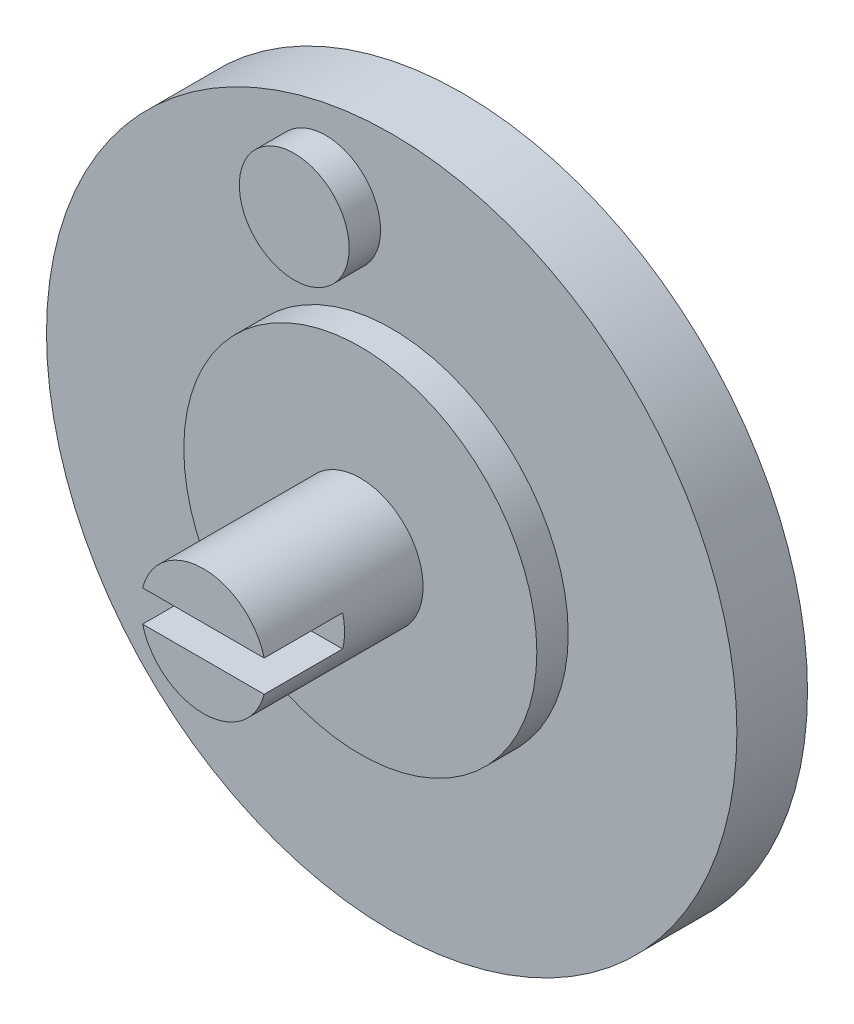
ISO-10303-21;
HEADER;
FILE_DESCRIPTION(('STEP AP214'),'2;1');
FILE_NAME('part.step','',(''),(''),'','','');
FILE_SCHEMA(('AUTOMOTIVE_DESIGN { 1 0 10303 214 1 1 1 1 }'));
ENDSEC;
DATA;
#1=APPLICATION_CONTEXT('core data for automotive mechanical design processes');
#2=APPLICATION_PROTOCOL_DEFINITION('international standard','automotive_design',2000,#1);
#3=PRODUCT_CONTEXT('',#1,'mechanical');
#4=PRODUCT('Part','Part','',(#3));
#5=PRODUCT_RELATED_PRODUCT_CATEGORY('part','',(#4));
#6=PRODUCT_DEFINITION_FORMATION('','',#4);
#7=PRODUCT_DEFINITION_CONTEXT('part definition',#1,'design');
#8=PRODUCT_DEFINITION('design','',#6,#7);
#9=PRODUCT_DEFINITION_SHAPE('','',#8);
#10=(LENGTH_UNIT() NAMED_UNIT(*) SI_UNIT(.MILLI.,.METRE.));
#11=(NAMED_UNIT(*) PLANE_ANGLE_UNIT() SI_UNIT($,.RADIAN.));
#12=(NAMED_UNIT(*) SI_UNIT($,.STERADIAN.) SOLID_ANGLE_UNIT());
#13=UNCERTAINTY_MEASURE_WITH_UNIT(LENGTH_MEASURE(1.E-05),#10,'distance_accuracy_value','');
#14=(GEOMETRIC_REPRESENTATION_CONTEXT(3) GLOBAL_UNCERTAINTY_ASSIGNED_CONTEXT((#13)) GLOBAL_UNIT_ASSIGNED_CONTEXT((#10,
#11,#12)) REPRESENTATION_CONTEXT('',''));
#15=CARTESIAN_POINT('',(0.,0.,0.));
#16=DIRECTION('',(0.,0.,1.));
#17=DIRECTION('',(1.,0.,0.));
#18=AXIS2_PLACEMENT_3D('',#15,#16,#17);
#19=CARTESIAN_POINT('',(0.,0.,16.5));
#20=DIRECTION('',(0.,0.,-1.));
#21=DIRECTION('',(-1.,0.,0.));
#22=AXIS2_PLACEMENT_3D('',#19,#20,#21);
#23=CYLINDRICAL_SURFACE('',#22,4.);
#24=CARTESIAN_POINT('',(0.,0.,6.5));
#25=DIRECTION('',(0.,0.,1.));
#26=DIRECTION('',(1.,0.,0.));
#27=AXIS2_PLACEMENT_3D('',#24,#25,#26);
#28=CIRCLE('',#27,4.);
#29=CARTESIAN_POINT('',(4.,0.,6.5));
#30=VERTEX_POINT('',#29);
#31=EDGE_CURVE('E89',#30,#30,#28,.T.);
#32=ORIENTED_EDGE('',*,*,#31,.T.);
#33=EDGE_LOOP('',(#32));
#34=FACE_BOUND('',#33,.T.);
#35=DIRECTION('',(0.,0.,-1.));
#36=VECTOR('',#35,1.);
#37=CARTESIAN_POINT('',(3.87298334620742,-1.,16.5));
#38=LINE('',#37,#36);
#39=CARTESIAN_POINT('',(3.87298334620742,-1.,16.5));
#40=VERTEX_POINT('',#39);
#41=CARTESIAN_POINT('',(3.87298334620742,-1.,11.5));
#42=VERTEX_POINT('',#41);
#43=EDGE_CURVE('E109',#40,#42,#38,.T.);
#44=ORIENTED_EDGE('',*,*,#43,.F.);
#45=CARTESIAN_POINT('',(0.,0.,16.5));
#46=DIRECTION('',(0.,0.,1.));
#47=DIRECTION('',(1.,0.,0.));
#48=AXIS2_PLACEMENT_3D('',#45,#46,#47);
#49=CIRCLE('',#48,4.);
#50=CARTESIAN_POINT('',(-3.87298334620742,-1.,16.5));
#51=VERTEX_POINT('',#50);
#52=EDGE_CURVE('E101',#51,#40,#49,.T.);
#53=ORIENTED_EDGE('',*,*,#52,.F.);
#54=DIRECTION('',(0.,0.,-1.));
#55=VECTOR('',#54,1.);
#56=CARTESIAN_POINT('',(-3.87298334620742,-1.,16.5));
#57=LINE('',#56,#55);
#58=CARTESIAN_POINT('',(-3.87298334620742,-1.,11.5));
#59=VERTEX_POINT('',#58);
#60=EDGE_CURVE('E96',#59,#51,#57,.F.);
#61=ORIENTED_EDGE('',*,*,#60,.F.);
#62=CARTESIAN_POINT('',(0.,0.,11.5));
#63=DIRECTION('',(0.,0.,-1.));
#64=DIRECTION('',(-1.,0.,0.));
#65=AXIS2_PLACEMENT_3D('',#62,#63,#64);
#66=CIRCLE('',#65,4.);
#67=CARTESIAN_POINT('',(-3.87298334620742,1.,11.5));
#68=VERTEX_POINT('',#67);
#69=EDGE_CURVE('E43',#59,#68,#66,.T.);
#70=ORIENTED_EDGE('',*,*,#69,.T.);
#71=DIRECTION('',(0.,0.,-1.));
#72=VECTOR('',#71,1.);
#73=CARTESIAN_POINT('',(-3.87298334620742,1.,16.5));
#74=LINE('',#73,#72);
#75=CARTESIAN_POINT('',(-3.87298334620742,1.,16.5));
#76=VERTEX_POINT('',#75);
#77=EDGE_CURVE('E83',#76,#68,#74,.T.);
#78=ORIENTED_EDGE('',*,*,#77,.F.);
#79=CARTESIAN_POINT('',(3.87298334620742,1.,16.5));
#80=VERTEX_POINT('',#79);
#81=EDGE_CURVE('E93',#80,#76,#49,.T.);
#82=ORIENTED_EDGE('',*,*,#81,.F.);
#83=DIRECTION('',(0.,0.,-1.));
#84=VECTOR('',#83,1.);
#85=CARTESIAN_POINT('',(3.87298334620742,1.,16.5));
#86=LINE('',#85,#84);
#87=CARTESIAN_POINT('',(3.87298334620742,1.,11.5));
#88=VERTEX_POINT('',#87);
#89=EDGE_CURVE('E55',#88,#80,#86,.F.);
#90=ORIENTED_EDGE('',*,*,#89,.F.);
#91=EDGE_CURVE('E11',#88,#42,#66,.T.);
#92=ORIENTED_EDGE('',*,*,#91,.T.);
#93=EDGE_LOOP('',(#44,#53,#61,#70,#78,#82,#90,#92));
#94=FACE_BOUND('',#93,.T.);
#95=ADVANCED_FACE('F39',(#34,#94),#23,.T.);
#96=CARTESIAN_POINT('',(0.,0.,16.5));
#97=DIRECTION('',(0.,0.,1.));
#98=DIRECTION('',(1.,0.,0.));
#99=AXIS2_PLACEMENT_3D('',#96,#97,#98);
#100=PLANE('',#99);
#101=ORIENTED_EDGE('',*,*,#52,.T.);
#102=DIRECTION('',(-1.,0.,0.));
#103=VECTOR('',#102,1.);
#104=CARTESIAN_POINT('',(0.,-1.,16.5));
#105=LINE('',#104,#103);
#106=EDGE_CURVE('E88',#40,#51,#105,.T.);
#107=ORIENTED_EDGE('',*,*,#106,.T.);
#108=EDGE_LOOP('',(#101,#107));
#109=FACE_BOUND('',#108,.T.);
#110=ADVANCED_FACE('F139',(#109),#100,.T.);
#111=ORIENTED_EDGE('',*,*,#81,.T.);
#112=DIRECTION('',(1.,0.,0.));
#113=VECTOR('',#112,1.);
#114=CARTESIAN_POINT('',(0.,1.,16.5));
#115=LINE('',#114,#113);
#116=EDGE_CURVE('E80',#76,#80,#115,.T.);
#117=ORIENTED_EDGE('',*,*,#116,.T.);
#118=EDGE_LOOP('',(#111,#117));
#119=FACE_BOUND('',#118,.T.);
#120=ADVANCED_FACE('F98',(#119),#100,.T.);
#121=CARTESIAN_POINT('',(0.,0.,4.5));
#122=DIRECTION('',(0.,0.,-1.));
#123=DIRECTION('',(-1.,0.,0.));
#124=AXIS2_PLACEMENT_3D('',#121,#122,#123);
#125=CYLINDRICAL_SURFACE('',#124,22.);
#126=CARTESIAN_POINT('',(0.,0.,4.5));
#127=DIRECTION('',(0.,0.,1.));
#128=DIRECTION('',(1.,0.,0.));
#129=AXIS2_PLACEMENT_3D('',#126,#127,#128);
#130=CIRCLE('',#129,22.);
#131=CARTESIAN_POINT('',(22.,0.,4.5));
#132=VERTEX_POINT('',#131);
#133=EDGE_CURVE('E128',#132,#132,#130,.T.);
#134=ORIENTED_EDGE('',*,*,#133,.F.);
#135=EDGE_LOOP('',(#134));
#136=FACE_BOUND('',#135,.T.);
#137=CARTESIAN_POINT('',(0.,0.,0.));
#138=DIRECTION('',(0.,0.,1.));
#139=DIRECTION('',(1.,0.,0.));
#140=AXIS2_PLACEMENT_3D('',#137,#138,#139);
#141=CIRCLE('',#140,22.);
#142=CARTESIAN_POINT('',(22.,0.,0.));
#143=VERTEX_POINT('',#142);
#144=EDGE_CURVE('E124',#143,#143,#141,.T.);
#145=ORIENTED_EDGE('',*,*,#144,.T.);
#146=EDGE_LOOP('',(#145));
#147=FACE_BOUND('',#146,.T.);
#148=ADVANCED_FACE('F41',(#136,#147),#125,.T.);
#149=CARTESIAN_POINT('',(0.,0.,4.5));
#150=DIRECTION('',(0.,0.,1.));
#151=DIRECTION('',(1.,0.,0.));
#152=AXIS2_PLACEMENT_3D('',#149,#150,#151);
#153=PLANE('',#152);
#154=CARTESIAN_POINT('',(-4.21044462051682,16.3154729045027,4.5));
#155=DIRECTION('',(0.,0.,1.));
#156=DIRECTION('',(1.,0.,0.));
#157=AXIS2_PLACEMENT_3D('',#154,#155,#156);
#158=CIRCLE('',#157,3.5);
#159=CARTESIAN_POINT('',(-0.710444620516826,16.3154729045027,4.5));
#160=VERTEX_POINT('',#159);
#161=EDGE_CURVE('E100',#160,#160,#158,.T.);
#162=ORIENTED_EDGE('',*,*,#161,.F.);
#163=EDGE_LOOP('',(#162));
#164=FACE_BOUND('',#163,.T.);
#165=CARTESIAN_POINT('',(0.,0.,4.5));
#166=DIRECTION('',(0.,0.,1.));
#167=DIRECTION('',(1.,0.,0.));
#168=AXIS2_PLACEMENT_3D('',#165,#166,#167);
#169=CIRCLE('',#168,11.25);
#170=CARTESIAN_POINT('',(11.25,0.,4.5));
#171=VERTEX_POINT('',#170);
#172=EDGE_CURVE('E116',#171,#171,#169,.T.);
#173=ORIENTED_EDGE('',*,*,#172,.F.);
#174=EDGE_LOOP('',(#173));
#175=FACE_BOUND('',#174,.T.);
#176=ORIENTED_EDGE('',*,*,#133,.T.);
#177=EDGE_LOOP('',(#176));
#178=FACE_BOUND('',#177,.T.);
#179=ADVANCED_FACE('F198',(#164,#175,#178),#153,.T.);
#180=CARTESIAN_POINT('',(0.,0.,0.));
#181=DIRECTION('',(0.,0.,1.));
#182=DIRECTION('',(1.,0.,0.));
#183=AXIS2_PLACEMENT_3D('',#180,#181,#182);
#184=PLANE('',#183);
#185=CARTESIAN_POINT('',(0.,0.,0.));
#186=DIRECTION('',(0.,0.,1.));
#187=DIRECTION('',(1.,0.,0.));
#188=AXIS2_PLACEMENT_3D('',#185,#186,#187);
#189=CIRCLE('',#188,13.);
#190=CARTESIAN_POINT('',(13.,0.,0.));
#191=VERTEX_POINT('',#190);
#192=EDGE_CURVE('E153',#191,#191,#189,.T.);
#193=ORIENTED_EDGE('',*,*,#192,.T.);
#194=EDGE_LOOP('',(#193));
#195=FACE_BOUND('',#194,.T.);
#196=ORIENTED_EDGE('',*,*,#144,.F.);
#197=EDGE_LOOP('',(#196));
#198=FACE_BOUND('',#197,.T.);
#199=ADVANCED_FACE('F196',(#195,#198),#184,.F.);
#200=CARTESIAN_POINT('',(0.,0.,6.5));
#201=DIRECTION('',(0.,0.,-1.));
#202=DIRECTION('',(-1.,0.,0.));
#203=AXIS2_PLACEMENT_3D('',#200,#201,#202);
#204=CYLINDRICAL_SURFACE('',#203,11.25);
#205=CARTESIAN_POINT('',(0.,0.,6.5));
#206=DIRECTION('',(0.,0.,1.));
#207=DIRECTION('',(1.,0.,0.));
#208=AXIS2_PLACEMENT_3D('',#205,#206,#207);
#209=CIRCLE('',#208,11.25);
#210=CARTESIAN_POINT('',(11.25,0.,6.5));
#211=VERTEX_POINT('',#210);
#212=EDGE_CURVE('E119',#211,#211,#209,.T.);
#213=ORIENTED_EDGE('',*,*,#212,.F.);
#214=EDGE_LOOP('',(#213));
#215=FACE_BOUND('',#214,.T.);
#216=ORIENTED_EDGE('',*,*,#172,.T.);
#217=EDGE_LOOP('',(#216));
#218=FACE_BOUND('',#217,.T.);
#219=ADVANCED_FACE('F192',(#215,#218),#204,.T.);
#220=CARTESIAN_POINT('',(0.,0.,6.5));
#221=DIRECTION('',(0.,0.,1.));
#222=DIRECTION('',(1.,0.,0.));
#223=AXIS2_PLACEMENT_3D('',#220,#221,#222);
#224=PLANE('',#223);
#225=ORIENTED_EDGE('',*,*,#31,.F.);
#226=EDGE_LOOP('',(#225));
#227=FACE_BOUND('',#226,.T.);
#228=ORIENTED_EDGE('',*,*,#212,.T.);
#229=EDGE_LOOP('',(#228));
#230=FACE_BOUND('',#229,.T.);
#231=ADVANCED_FACE('F188',(#227,#230),#224,.T.);
#232=CARTESIAN_POINT('',(-4.21044462051682,16.3154729045027,6.5));
#233=DIRECTION('',(0.,0.,-1.));
#234=DIRECTION('',(-1.,0.,0.));
#235=AXIS2_PLACEMENT_3D('',#232,#233,#234);
#236=CYLINDRICAL_SURFACE('',#235,3.5);
#237=CARTESIAN_POINT('',(-4.21044462051682,16.3154729045027,6.5));
#238=DIRECTION('',(0.,0.,1.));
#239=DIRECTION('',(1.,0.,0.));
#240=AXIS2_PLACEMENT_3D('',#237,#238,#239);
#241=CIRCLE('',#240,3.5);
#242=CARTESIAN_POINT('',(-0.710444620516826,16.3154729045027,6.5));
#243=VERTEX_POINT('',#242);
#244=EDGE_CURVE('E106',#243,#243,#241,.T.);
#245=ORIENTED_EDGE('',*,*,#244,.F.);
#246=EDGE_LOOP('',(#245));
#247=FACE_BOUND('',#246,.T.);
#248=ORIENTED_EDGE('',*,*,#161,.T.);
#249=EDGE_LOOP('',(#248));
#250=FACE_BOUND('',#249,.T.);
#251=ADVANCED_FACE('F184',(#247,#250),#236,.T.);
#252=CARTESIAN_POINT('',(-4.21044462051682,16.3154729045027,6.5));
#253=DIRECTION('',(0.,0.,1.));
#254=DIRECTION('',(1.,0.,0.));
#255=AXIS2_PLACEMENT_3D('',#252,#253,#254);
#256=PLANE('',#255);
#257=ORIENTED_EDGE('',*,*,#244,.T.);
#258=EDGE_LOOP('',(#257));
#259=FACE_BOUND('',#258,.T.);
#260=ADVANCED_FACE('F180',(#259),#256,.T.);
#261=CARTESIAN_POINT('',(0.,0.,11.5));
#262=DIRECTION('',(0.,0.,-1.));
#263=DIRECTION('',(-1.,0.,0.));
#264=AXIS2_PLACEMENT_3D('',#261,#262,#263);
#265=PLANE('',#264);
#266=DIRECTION('',(1.,0.,0.));
#267=VECTOR('',#266,1.);
#268=CARTESIAN_POINT('',(0.,1.,11.5));
#269=LINE('',#268,#267);
#270=EDGE_CURVE('E146',#68,#88,#269,.T.);
#271=ORIENTED_EDGE('',*,*,#270,.F.);
#272=ORIENTED_EDGE('',*,*,#69,.F.);
#273=DIRECTION('',(-1.,0.,0.));
#274=VECTOR('',#273,1.);
#275=CARTESIAN_POINT('',(0.,-1.,11.5));
#276=LINE('',#275,#274);
#277=EDGE_CURVE('E149',#42,#59,#276,.T.);
#278=ORIENTED_EDGE('',*,*,#277,.F.);
#279=ORIENTED_EDGE('',*,*,#91,.F.);
#280=EDGE_LOOP('',(#271,#272,#278,#279));
#281=FACE_BOUND('',#280,.T.);
#282=ADVANCED_FACE('F183',(#281),#265,.F.);
#283=CARTESIAN_POINT('',(0.,-1.,11.5));
#284=DIRECTION('',(0.,1.,0.));
#285=DIRECTION('',(0.,0.,1.));
#286=AXIS2_PLACEMENT_3D('',#283,#284,#285);
#287=PLANE('',#286);
#288=ORIENTED_EDGE('',*,*,#43,.T.);
#289=ORIENTED_EDGE('',*,*,#277,.T.);
#290=ORIENTED_EDGE('',*,*,#60,.T.);
#291=ORIENTED_EDGE('',*,*,#106,.F.);
#292=EDGE_LOOP('',(#288,#289,#290,#291));
#293=FACE_BOUND('',#292,.T.);
#294=ADVANCED_FACE('F288',(#293),#287,.T.);
#295=CARTESIAN_POINT('',(0.,1.,11.5));
#296=DIRECTION('',(0.,-1.,0.));
#297=DIRECTION('',(1.,0.,0.));
#298=AXIS2_PLACEMENT_3D('',#295,#296,#297);
#299=PLANE('',#298);
#300=ORIENTED_EDGE('',*,*,#77,.T.);
#301=ORIENTED_EDGE('',*,*,#270,.T.);
#302=ORIENTED_EDGE('',*,*,#89,.T.);
#303=ORIENTED_EDGE('',*,*,#116,.F.);
#304=EDGE_LOOP('',(#300,#301,#302,#303));
#305=FACE_BOUND('',#304,.T.);
#306=ADVANCED_FACE('F82',(#305),#299,.T.);
#307=CARTESIAN_POINT('',(0.,0.,4.));
#308=DIRECTION('',(0.,0.,-1.));
#309=DIRECTION('',(-1.,0.,0.));
#310=AXIS2_PLACEMENT_3D('',#307,#308,#309);
#311=CYLINDRICAL_SURFACE('',#310,13.);
#312=CARTESIAN_POINT('',(0.,0.,4.));
#313=DIRECTION('',(0.,0.,1.));
#314=DIRECTION('',(1.,0.,0.));
#315=AXIS2_PLACEMENT_3D('',#312,#313,#314);
#316=CIRCLE('',#315,13.);
#317=CARTESIAN_POINT('',(13.,0.,4.));
#318=VERTEX_POINT('',#317);
#319=EDGE_CURVE('E152',#318,#318,#316,.T.);
#320=ORIENTED_EDGE('',*,*,#319,.T.);
#321=EDGE_LOOP('',(#320));
#322=FACE_BOUND('',#321,.T.);
#323=ORIENTED_EDGE('',*,*,#192,.F.);
#324=EDGE_LOOP('',(#323));
#325=FACE_BOUND('',#324,.T.);
#326=ADVANCED_FACE('F161',(#322,#325),#311,.F.);
#327=CARTESIAN_POINT('',(0.,0.,4.));
#328=DIRECTION('',(0.,0.,1.));
#329=DIRECTION('',(1.,0.,0.));
#330=AXIS2_PLACEMENT_3D('',#327,#328,#329);
#331=PLANE('',#330);
#332=ORIENTED_EDGE('',*,*,#319,.F.);
#333=EDGE_LOOP('',(#332));
#334=FACE_BOUND('',#333,.T.);
#335=ADVANCED_FACE('F164',(#334),#331,.F.);
#336=CLOSED_SHELL('',(#95,#110,#120,#148,#179,#199,#219,#231,#251,#260,#282,#294,#306,#326,#335));
#337=MANIFOLD_SOLID_BREP('B2',#336);
#338=ADVANCED_BREP_SHAPE_REPRESENTATION('',(#18,#337),#14);
#339=SHAPE_DEFINITION_REPRESENTATION(#9,#338);
ENDSEC;
END-ISO-10303-21;
